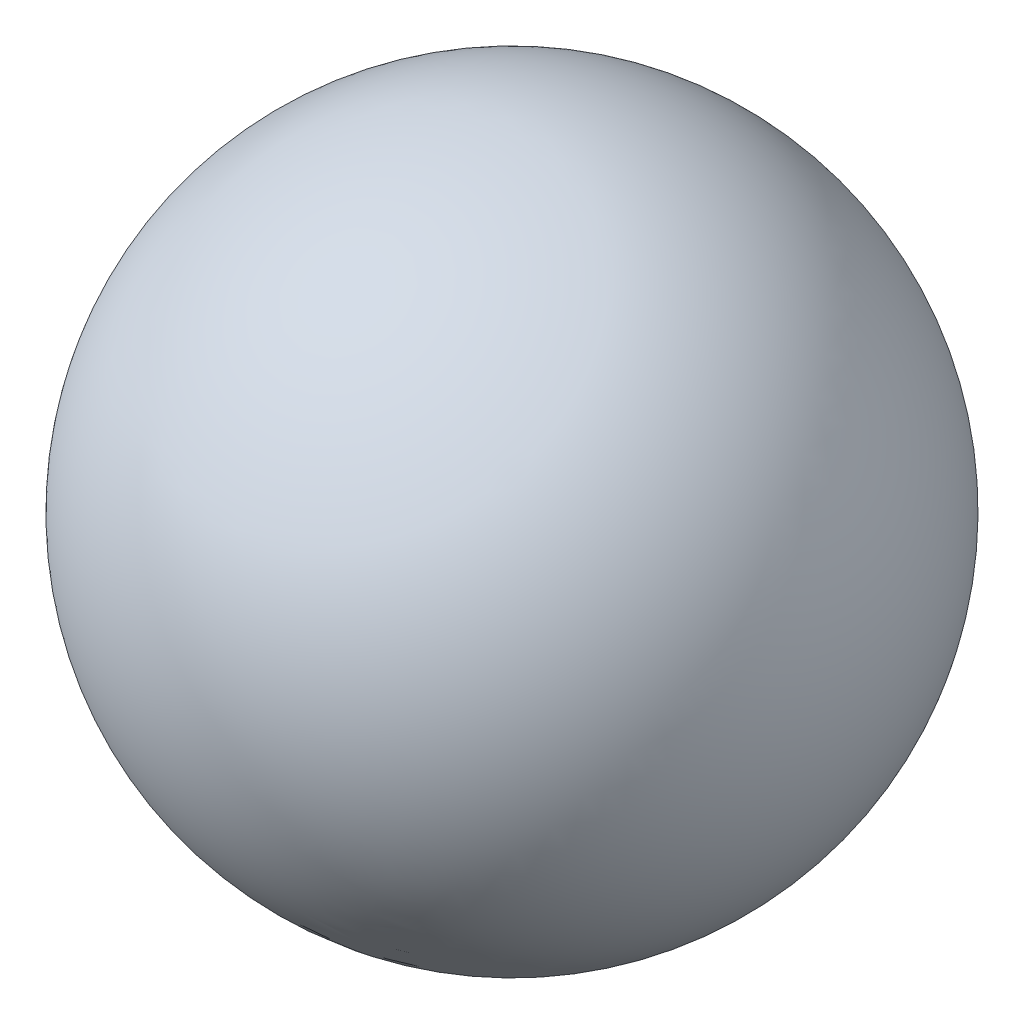
ISO-10303-21;
HEADER;
FILE_DESCRIPTION(('STEP AP214'),'2;1');
FILE_NAME('part.step','',(''),(''),'','','');
FILE_SCHEMA(('AUTOMOTIVE_DESIGN { 1 0 10303 214 1 1 1 1 }'));
ENDSEC;
DATA;
#1=APPLICATION_CONTEXT('core data for automotive mechanical design processes');
#2=APPLICATION_PROTOCOL_DEFINITION('international standard','automotive_design',2000,#1);
#3=PRODUCT_CONTEXT('',#1,'mechanical');
#4=PRODUCT('Part','Part','',(#3));
#5=PRODUCT_RELATED_PRODUCT_CATEGORY('part','',(#4));
#6=PRODUCT_DEFINITION_FORMATION('','',#4);
#7=PRODUCT_DEFINITION_CONTEXT('part definition',#1,'design');
#8=PRODUCT_DEFINITION('design','',#6,#7);
#9=PRODUCT_DEFINITION_SHAPE('','',#8);
#10=(LENGTH_UNIT() NAMED_UNIT(*) SI_UNIT(.MILLI.,.METRE.));
#11=(NAMED_UNIT(*) PLANE_ANGLE_UNIT() SI_UNIT($,.RADIAN.));
#12=(NAMED_UNIT(*) SI_UNIT($,.STERADIAN.) SOLID_ANGLE_UNIT());
#13=UNCERTAINTY_MEASURE_WITH_UNIT(LENGTH_MEASURE(1.E-05),#10,'distance_accuracy_value','');
#14=(GEOMETRIC_REPRESENTATION_CONTEXT(3) GLOBAL_UNCERTAINTY_ASSIGNED_CONTEXT((#13)) GLOBAL_UNIT_ASSIGNED_CONTEXT((#10,
#11,#12)) REPRESENTATION_CONTEXT('',''));
#15=CARTESIAN_POINT('',(0.,0.,0.));
#16=DIRECTION('',(0.,0.,1.));
#17=DIRECTION('',(1.,0.,0.));
#18=AXIS2_PLACEMENT_3D('',#15,#16,#17);
#19=CARTESIAN_POINT('',(0.,0.,0.));
#20=DIRECTION('',(0.567722337698335,0.622276437730593,0.538946548670331));
#21=DIRECTION('',(0.182620046653892,-0.733568668389397,0.654619681431545));
#22=AXIS2_PLACEMENT_3D('',#19,#20,#21);
#23=SPHERICAL_SURFACE('',#22,0.794);
#24=CARTESIAN_POINT('',(0.450771536132478,0.494087491558091,0.427923559644243));
#25=VERTEX_POINT('',#24);
#26=VERTEX_LOOP('',#25);
#27=FACE_BOUND('',#26,.T.);
#28=CARTESIAN_POINT('',(-0.450771536132478,-0.494087491558092,-0.427923559644243));
#29=VERTEX_POINT('',#28);
#30=VERTEX_LOOP('',#29);
#31=FACE_BOUND('',#30,.T.);
#32=ADVANCED_FACE('F15',(#27,#31),#23,.T.);
#33=CLOSED_SHELL('',(#32));
#34=MANIFOLD_SOLID_BREP('B1',#33);
#35=ADVANCED_BREP_SHAPE_REPRESENTATION('',(#18,#34),#14);
#36=SHAPE_DEFINITION_REPRESENTATION(#9,#35);
ENDSEC;
END-ISO-10303-21;
